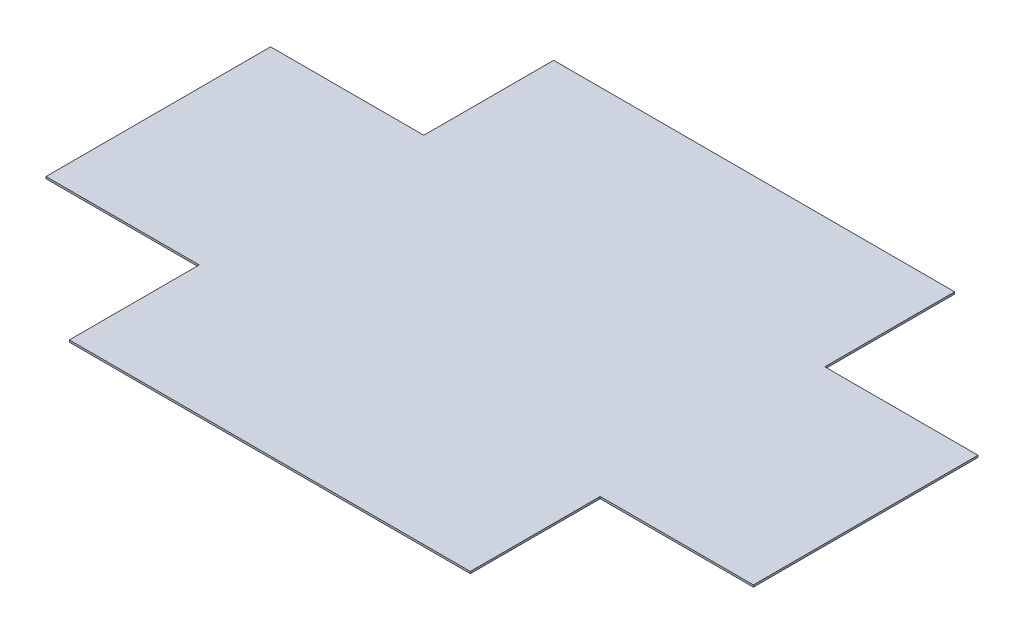
ISO-10303-21;
HEADER;
FILE_DESCRIPTION(('STEP AP214'),'2;1');
FILE_NAME('part.step','',(''),(''),'','','');
FILE_SCHEMA(('AUTOMOTIVE_DESIGN { 1 0 10303 214 1 1 1 1 }'));
ENDSEC;
DATA;
#1=APPLICATION_CONTEXT('core data for automotive mechanical design processes');
#2=APPLICATION_PROTOCOL_DEFINITION('international standard','automotive_design',2000,#1);
#3=PRODUCT_CONTEXT('',#1,'mechanical');
#4=PRODUCT('Part','Part','',(#3));
#5=PRODUCT_RELATED_PRODUCT_CATEGORY('part','',(#4));
#6=PRODUCT_DEFINITION_FORMATION('','',#4);
#7=PRODUCT_DEFINITION_CONTEXT('part definition',#1,'design');
#8=PRODUCT_DEFINITION('design','',#6,#7);
#9=PRODUCT_DEFINITION_SHAPE('','',#8);
#10=(LENGTH_UNIT() NAMED_UNIT(*) SI_UNIT(.MILLI.,.METRE.));
#11=(NAMED_UNIT(*) PLANE_ANGLE_UNIT() SI_UNIT($,.RADIAN.));
#12=(NAMED_UNIT(*) SI_UNIT($,.STERADIAN.) SOLID_ANGLE_UNIT());
#13=UNCERTAINTY_MEASURE_WITH_UNIT(LENGTH_MEASURE(1.E-05),#10,'distance_accuracy_value','');
#14=(GEOMETRIC_REPRESENTATION_CONTEXT(3) GLOBAL_UNCERTAINTY_ASSIGNED_CONTEXT((#13)) GLOBAL_UNIT_ASSIGNED_CONTEXT((#10,
#11,#12)) REPRESENTATION_CONTEXT('',''));
#15=CARTESIAN_POINT('',(0.,0.,0.));
#16=DIRECTION('',(0.,0.,1.));
#17=DIRECTION('',(1.,0.,0.));
#18=AXIS2_PLACEMENT_3D('',#15,#16,#17);
#19=CARTESIAN_POINT('',(0.,-1.49999999999997,0.));
#20=DIRECTION('',(0.,-1.,0.));
#21=DIRECTION('',(0.,0.,-1.));
#22=AXIS2_PLACEMENT_3D('',#19,#20,#21);
#23=PLANE('',#22);
#24=DIRECTION('',(0.,0.,1.));
#25=VECTOR('',#24,1.);
#26=CARTESIAN_POINT('',(-153.464644660941,-1.49999999999995,87.5985458194132));
#27=LINE('',#26,#25);
#28=CARTESIAN_POINT('',(-153.464644660941,-1.49999999999994,85.9646446609406));
#29=VERTEX_POINT('',#28);
#30=CARTESIAN_POINT('',(-153.464644660941,-1.50000000000064,185.361945819413));
#31=VERTEX_POINT('',#30);
#32=EDGE_CURVE('E516',#29,#31,#27,.T.);
#33=ORIENTED_EDGE('',*,*,#32,.F.);
#34=DIRECTION('',(1.,0.,0.));
#35=VECTOR('',#34,1.);
#36=CARTESIAN_POINT('',(-252.223891638827,-1.50000000000064,85.964644660941));
#37=LINE('',#36,#35);
#38=CARTESIAN_POINT('',(-270.723891638827,-1.50000000000089,85.964644660941));
#39=VERTEX_POINT('',#38);
#40=EDGE_CURVE('E13',#39,#29,#37,.T.);
#41=ORIENTED_EDGE('',*,*,#40,.F.);
#42=DIRECTION('',(0.,0.,1.));
#43=VECTOR('',#42,1.);
#44=CARTESIAN_POINT('',(-270.723891638827,-1.50000000000089,85.964644660941));
#45=LINE('',#44,#43);
#46=CARTESIAN_POINT('',(-270.723891638827,-1.50000000000095,-85.9646446609407));
#47=VERTEX_POINT('',#46);
#48=EDGE_CURVE('E563',#47,#39,#45,.T.);
#49=ORIENTED_EDGE('',*,*,#48,.F.);
#50=DIRECTION('',(-1.,0.,0.));
#51=VECTOR('',#50,1.);
#52=CARTESIAN_POINT('',(-270.723891638827,-1.50000000000095,-85.9646446609407));
#53=LINE('',#52,#51);
#54=CARTESIAN_POINT('',(-153.464644660941,-1.5,-85.9646446609407));
#55=VERTEX_POINT('',#54);
#56=EDGE_CURVE('E412',#55,#47,#53,.T.);
#57=ORIENTED_EDGE('',*,*,#56,.F.);
#58=DIRECTION('',(0.,0.,-1.));
#59=VECTOR('',#58,1.);
#60=CARTESIAN_POINT('',(-153.464644660941,-1.5,-87.5985458194133));
#61=LINE('',#60,#59);
#62=CARTESIAN_POINT('',(-153.464644660941,-1.50000000000033,-185.361945819413));
#63=VERTEX_POINT('',#62);
#64=EDGE_CURVE('E575',#55,#63,#61,.T.);
#65=ORIENTED_EDGE('',*,*,#64,.T.);
#66=DIRECTION('',(1.,0.,0.));
#67=VECTOR('',#66,1.);
#68=CARTESIAN_POINT('',(155.,-1.50000000000033,-185.361945819413));
#69=LINE('',#68,#67);
#70=CARTESIAN_POINT('',(153.464644660941,-1.50000000000031,-185.361945819413));
#71=VERTEX_POINT('',#70);
#72=EDGE_CURVE('E439',#71,#63,#69,.F.);
#73=ORIENTED_EDGE('',*,*,#72,.F.);
#74=DIRECTION('',(0.,0.,-1.));
#75=VECTOR('',#74,1.);
#76=CARTESIAN_POINT('',(153.464644660941,-1.49999999999997,-87.5985458194133));
#77=LINE('',#76,#75);
#78=CARTESIAN_POINT('',(153.464644660941,-1.5,-85.9646446609408));
#79=VERTEX_POINT('',#78);
#80=EDGE_CURVE('E564',#79,#71,#77,.T.);
#81=ORIENTED_EDGE('',*,*,#80,.F.);
#82=DIRECTION('',(1.,0.,0.));
#83=VECTOR('',#82,1.);
#84=CARTESIAN_POINT('',(270.723891638827,-1.50000000000089,-85.9646446609407));
#85=LINE('',#84,#83);
#86=CARTESIAN_POINT('',(270.723891638827,-1.50000000000089,-85.9646446609407));
#87=VERTEX_POINT('',#86);
#88=EDGE_CURVE('E554',#87,#79,#85,.F.);
#89=ORIENTED_EDGE('',*,*,#88,.F.);
#90=DIRECTION('',(0.,0.,1.));
#91=VECTOR('',#90,1.);
#92=CARTESIAN_POINT('',(270.723891638827,-1.50000000000089,85.9646446609409));
#93=LINE('',#92,#91);
#94=CARTESIAN_POINT('',(270.723891638827,-1.50000000000089,85.9646446609409));
#95=VERTEX_POINT('',#94);
#96=EDGE_CURVE('E533',#95,#87,#93,.F.);
#97=ORIENTED_EDGE('',*,*,#96,.F.);
#98=DIRECTION('',(-1.,0.,0.));
#99=VECTOR('',#98,1.);
#100=CARTESIAN_POINT('',(252.223891638827,-1.50000000000058,85.9646446609409));
#101=LINE('',#100,#99);
#102=CARTESIAN_POINT('',(153.464644660941,-1.49999999999994,85.9646446609406));
#103=VERTEX_POINT('',#102);
#104=EDGE_CURVE('E461',#103,#95,#101,.F.);
#105=ORIENTED_EDGE('',*,*,#104,.F.);
#106=DIRECTION('',(0.,0.,1.));
#107=VECTOR('',#106,1.);
#108=CARTESIAN_POINT('',(153.464644660941,-1.49999999999995,87.5985458194132));
#109=LINE('',#108,#107);
#110=CARTESIAN_POINT('',(153.464644660941,-1.50000000000064,185.361945819413));
#111=VERTEX_POINT('',#110);
#112=EDGE_CURVE('E542',#103,#111,#109,.T.);
#113=ORIENTED_EDGE('',*,*,#112,.T.);
#114=DIRECTION('',(1.,0.,0.));
#115=VECTOR('',#114,1.);
#116=CARTESIAN_POINT('',(155.,-1.50000000000064,185.361945819413));
#117=LINE('',#116,#115);
#118=EDGE_CURVE('E487',#31,#111,#117,.T.);
#119=ORIENTED_EDGE('',*,*,#118,.F.);
#120=EDGE_LOOP('',(#33,#41,#49,#57,#65,#73,#81,#89,#97,#105,#113,#119));
#121=FACE_BOUND('',#120,.T.);
#122=ADVANCED_FACE('F381',(#121),#23,.T.);
#123=CARTESIAN_POINT('',(0.,0.,0.));
#124=DIRECTION('',(0.,-1.,0.));
#125=DIRECTION('',(0.,0.,-1.));
#126=AXIS2_PLACEMENT_3D('',#123,#124,#125);
#127=PLANE('',#126);
#128=DIRECTION('',(0.,0.,-1.));
#129=VECTOR('',#128,1.);
#130=CARTESIAN_POINT('',(-153.464644660941,0.,-87.5985458194133));
#131=LINE('',#130,#129);
#132=CARTESIAN_POINT('',(-153.464644660941,0.,-85.9646446609407));
#133=VERTEX_POINT('',#132);
#134=CARTESIAN_POINT('',(-153.464644660941,-3.33066907387547E-13,-185.361945819413));
#135=VERTEX_POINT('',#134);
#136=EDGE_CURVE('E489',#133,#135,#131,.T.);
#137=ORIENTED_EDGE('',*,*,#136,.F.);
#138=DIRECTION('',(1.,0.,0.));
#139=VECTOR('',#138,1.);
#140=CARTESIAN_POINT('',(-405.723891638826,-2.80331313717852E-12,-85.9646446609407));
#141=LINE('',#140,#139);
#142=CARTESIAN_POINT('',(-270.723891638827,-9.43689570931383E-13,-85.9646446609407));
#143=VERTEX_POINT('',#142);
#144=EDGE_CURVE('E585',#133,#143,#141,.F.);
#145=ORIENTED_EDGE('',*,*,#144,.T.);
#146=DIRECTION('',(0.,0.,-1.));
#147=VECTOR('',#146,1.);
#148=CARTESIAN_POINT('',(-270.723891638827,-9.43689570931383E-13,0.));
#149=LINE('',#148,#147);
#150=CARTESIAN_POINT('',(-270.723891638827,-8.88178419700125E-13,85.964644660941));
#151=VERTEX_POINT('',#150);
#152=EDGE_CURVE('E518',#143,#151,#149,.F.);
#153=ORIENTED_EDGE('',*,*,#152,.T.);
#154=DIRECTION('',(-1.,0.,0.));
#155=VECTOR('',#154,1.);
#156=CARTESIAN_POINT('',(-405.723891638826,-2.74780198594726E-12,85.964644660941));
#157=LINE('',#156,#155);
#158=CARTESIAN_POINT('',(-153.464644660941,0.,85.9646446609406));
#159=VERTEX_POINT('',#158);
#160=EDGE_CURVE('E391',#151,#159,#157,.F.);
#161=ORIENTED_EDGE('',*,*,#160,.T.);
#162=DIRECTION('',(0.,0.,1.));
#163=VECTOR('',#162,1.);
#164=CARTESIAN_POINT('',(-153.464644660941,0.,87.5985458194132));
#165=LINE('',#164,#163);
#166=CARTESIAN_POINT('',(-153.464644660941,-6.38378239159465E-13,185.361945819413));
#167=VERTEX_POINT('',#166);
#168=EDGE_CURVE('E509',#159,#167,#165,.T.);
#169=ORIENTED_EDGE('',*,*,#168,.T.);
#170=DIRECTION('',(-1.,0.,0.));
#171=VECTOR('',#170,1.);
#172=CARTESIAN_POINT('',(0.,-6.66133814775094E-13,185.361945819413));
#173=LINE('',#172,#171);
#174=CARTESIAN_POINT('',(153.464644660941,-6.38378239159465E-13,185.361945819413));
#175=VERTEX_POINT('',#174);
#176=EDGE_CURVE('E473',#167,#175,#173,.F.);
#177=ORIENTED_EDGE('',*,*,#176,.T.);
#178=DIRECTION('',(0.,0.,1.));
#179=VECTOR('',#178,1.);
#180=CARTESIAN_POINT('',(153.464644660941,0.,87.5985458194132));
#181=LINE('',#180,#179);
#182=CARTESIAN_POINT('',(153.464644660941,0.,85.9646446609406));
#183=VERTEX_POINT('',#182);
#184=EDGE_CURVE('E540',#183,#175,#181,.T.);
#185=ORIENTED_EDGE('',*,*,#184,.F.);
#186=DIRECTION('',(1.,0.,0.));
#187=VECTOR('',#186,1.);
#188=CARTESIAN_POINT('',(405.723891638826,-2.74780198594726E-12,85.9646446609409));
#189=LINE('',#188,#187);
#190=CARTESIAN_POINT('',(270.723891638827,-8.88178419700125E-13,85.9646446609409));
#191=VERTEX_POINT('',#190);
#192=EDGE_CURVE('E555',#183,#191,#189,.T.);
#193=ORIENTED_EDGE('',*,*,#192,.T.);
#194=DIRECTION('',(0.,0.,-1.));
#195=VECTOR('',#194,1.);
#196=CARTESIAN_POINT('',(270.723891638827,-8.88178419700125E-13,0.));
#197=LINE('',#196,#195);
#198=CARTESIAN_POINT('',(270.723891638827,-8.88178419700125E-13,-85.9646446609407));
#199=VERTEX_POINT('',#198);
#200=EDGE_CURVE('E551',#191,#199,#197,.T.);
#201=ORIENTED_EDGE('',*,*,#200,.T.);
#202=DIRECTION('',(-1.,0.,0.));
#203=VECTOR('',#202,1.);
#204=CARTESIAN_POINT('',(405.723891638826,-2.74780198594726E-12,-85.9646446609407));
#205=LINE('',#204,#203);
#206=CARTESIAN_POINT('',(153.464644660941,0.,-85.9646446609408));
#207=VERTEX_POINT('',#206);
#208=EDGE_CURVE('E558',#199,#207,#205,.T.);
#209=ORIENTED_EDGE('',*,*,#208,.T.);
#210=DIRECTION('',(0.,0.,-1.));
#211=VECTOR('',#210,1.);
#212=CARTESIAN_POINT('',(153.464644660941,0.,-87.5985458194133));
#213=LINE('',#212,#211);
#214=CARTESIAN_POINT('',(153.464644660941,-3.05311331771918E-13,-185.361945819413));
#215=VERTEX_POINT('',#214);
#216=EDGE_CURVE('E567',#207,#215,#213,.T.);
#217=ORIENTED_EDGE('',*,*,#216,.T.);
#218=DIRECTION('',(-1.,0.,0.));
#219=VECTOR('',#218,1.);
#220=CARTESIAN_POINT('',(0.,-3.60822483003176E-13,-185.361945819413));
#221=LINE('',#220,#219);
#222=EDGE_CURVE('E425',#215,#135,#221,.T.);
#223=ORIENTED_EDGE('',*,*,#222,.T.);
#224=EDGE_LOOP('',(#137,#145,#153,#161,#169,#177,#185,#193,#201,#209,#217,#223));
#225=FACE_BOUND('',#224,.T.);
#226=ADVANCED_FACE('F383',(#225),#127,.F.);
#227=CARTESIAN_POINT('',(-270.723891638827,-1.50000000000089,85.964644660941));
#228=DIRECTION('',(-1.,0.,0.));
#229=DIRECTION('',(0.,-1.,0.));
#230=AXIS2_PLACEMENT_3D('',#227,#228,#229);
#231=PLANE('',#230);
#232=ORIENTED_EDGE('',*,*,#152,.F.);
#233=DIRECTION('',(0.,1.,0.));
#234=VECTOR('',#233,1.);
#235=CARTESIAN_POINT('',(-270.723891638827,-1.50000000000095,-85.9646446609407));
#236=LINE('',#235,#234);
#237=EDGE_CURVE('E586',#47,#143,#236,.T.);
#238=ORIENTED_EDGE('',*,*,#237,.F.);
#239=ORIENTED_EDGE('',*,*,#48,.T.);
#240=DIRECTION('',(0.,1.,0.));
#241=VECTOR('',#240,1.);
#242=CARTESIAN_POINT('',(-270.723891638827,-1.50000000000089,85.964644660941));
#243=LINE('',#242,#241);
#244=EDGE_CURVE('E399',#39,#151,#243,.T.);
#245=ORIENTED_EDGE('',*,*,#244,.T.);
#246=EDGE_LOOP('',(#232,#238,#239,#245));
#247=FACE_BOUND('',#246,.T.);
#248=ADVANCED_FACE('F631',(#247),#231,.T.);
#249=CARTESIAN_POINT('',(-270.723891638827,-1.50000000000095,-85.9646446609407));
#250=DIRECTION('',(0.,0.,-1.));
#251=DIRECTION('',(0.,-1.,0.));
#252=AXIS2_PLACEMENT_3D('',#249,#250,#251);
#253=PLANE('',#252);
#254=ORIENTED_EDGE('',*,*,#144,.F.);
#255=DIRECTION('',(0.,-1.,0.));
#256=VECTOR('',#255,1.);
#257=CARTESIAN_POINT('',(-153.464644660941,0.,-85.9646446609407));
#258=LINE('',#257,#256);
#259=EDGE_CURVE('E530',#133,#55,#258,.T.);
#260=ORIENTED_EDGE('',*,*,#259,.T.);
#261=ORIENTED_EDGE('',*,*,#56,.T.);
#262=ORIENTED_EDGE('',*,*,#237,.T.);
#263=EDGE_LOOP('',(#254,#260,#261,#262));
#264=FACE_BOUND('',#263,.T.);
#265=ADVANCED_FACE('F636',(#264),#253,.T.);
#266=CARTESIAN_POINT('',(-252.223891638827,-1.50000000000064,85.964644660941));
#267=DIRECTION('',(0.,0.,1.));
#268=DIRECTION('',(0.,1.,0.));
#269=AXIS2_PLACEMENT_3D('',#266,#267,#268);
#270=PLANE('',#269);
#271=ORIENTED_EDGE('',*,*,#40,.T.);
#272=DIRECTION('',(0.,-1.,0.));
#273=VECTOR('',#272,1.);
#274=CARTESIAN_POINT('',(-153.464644660941,0.,85.9646446609406));
#275=LINE('',#274,#273);
#276=EDGE_CURVE('E514',#159,#29,#275,.T.);
#277=ORIENTED_EDGE('',*,*,#276,.F.);
#278=ORIENTED_EDGE('',*,*,#160,.F.);
#279=ORIENTED_EDGE('',*,*,#244,.F.);
#280=EDGE_LOOP('',(#271,#277,#278,#279));
#281=FACE_BOUND('',#280,.T.);
#282=ADVANCED_FACE('F520',(#281),#270,.T.);
#283=CARTESIAN_POINT('',(155.,-1.50000000000033,-185.361945819413));
#284=DIRECTION('',(0.,0.,-1.));
#285=DIRECTION('',(0.,1.,0.));
#286=AXIS2_PLACEMENT_3D('',#283,#284,#285);
#287=PLANE('',#286);
#288=ORIENTED_EDGE('',*,*,#72,.T.);
#289=DIRECTION('',(0.,1.,0.));
#290=VECTOR('',#289,1.);
#291=CARTESIAN_POINT('',(-153.464644660941,-1.50000000000033,-185.361945819413));
#292=LINE('',#291,#290);
#293=EDGE_CURVE('E579',#63,#135,#292,.T.);
#294=ORIENTED_EDGE('',*,*,#293,.T.);
#295=ORIENTED_EDGE('',*,*,#222,.F.);
#296=DIRECTION('',(0.,1.,0.));
#297=VECTOR('',#296,1.);
#298=CARTESIAN_POINT('',(153.464644660941,-1.50000000000031,-185.361945819413));
#299=LINE('',#298,#297);
#300=EDGE_CURVE('E561',#71,#215,#299,.T.);
#301=ORIENTED_EDGE('',*,*,#300,.F.);
#302=EDGE_LOOP('',(#288,#294,#295,#301));
#303=FACE_BOUND('',#302,.T.);
#304=ADVANCED_FACE('F635',(#303),#287,.T.);
#305=CARTESIAN_POINT('',(-153.464644660941,-1.5,-87.5985458194133));
#306=DIRECTION('',(1.,0.,0.));
#307=DIRECTION('',(0.,1.,0.));
#308=AXIS2_PLACEMENT_3D('',#305,#306,#307);
#309=PLANE('',#308);
#310=ORIENTED_EDGE('',*,*,#136,.T.);
#311=ORIENTED_EDGE('',*,*,#293,.F.);
#312=ORIENTED_EDGE('',*,*,#64,.F.);
#313=ORIENTED_EDGE('',*,*,#259,.F.);
#314=EDGE_LOOP('',(#310,#311,#312,#313));
#315=FACE_BOUND('',#314,.T.);
#316=ADVANCED_FACE('F622',(#315),#309,.F.);
#317=CARTESIAN_POINT('',(153.464644660941,-1.49999999999997,-87.5985458194133));
#318=DIRECTION('',(1.,0.,0.));
#319=DIRECTION('',(0.,0.,-1.));
#320=AXIS2_PLACEMENT_3D('',#317,#318,#319);
#321=PLANE('',#320);
#322=ORIENTED_EDGE('',*,*,#216,.F.);
#323=DIRECTION('',(0.,-1.,0.));
#324=VECTOR('',#323,1.);
#325=CARTESIAN_POINT('',(153.464644660941,0.,-85.9646446609408));
#326=LINE('',#325,#324);
#327=EDGE_CURVE('E525',#207,#79,#326,.T.);
#328=ORIENTED_EDGE('',*,*,#327,.T.);
#329=ORIENTED_EDGE('',*,*,#80,.T.);
#330=ORIENTED_EDGE('',*,*,#300,.T.);
#331=EDGE_LOOP('',(#322,#328,#329,#330));
#332=FACE_BOUND('',#331,.T.);
#333=ADVANCED_FACE('F614',(#332),#321,.T.);
#334=CARTESIAN_POINT('',(270.723891638827,-1.50000000000089,85.9646446609409));
#335=DIRECTION('',(1.,0.,0.));
#336=DIRECTION('',(0.,1.,0.));
#337=AXIS2_PLACEMENT_3D('',#334,#335,#336);
#338=PLANE('',#337);
#339=ORIENTED_EDGE('',*,*,#200,.F.);
#340=DIRECTION('',(0.,1.,0.));
#341=VECTOR('',#340,1.);
#342=CARTESIAN_POINT('',(270.723891638827,-1.50000000000089,85.9646446609409));
#343=LINE('',#342,#341);
#344=EDGE_CURVE('E556',#95,#191,#343,.T.);
#345=ORIENTED_EDGE('',*,*,#344,.F.);
#346=ORIENTED_EDGE('',*,*,#96,.T.);
#347=DIRECTION('',(0.,1.,0.));
#348=VECTOR('',#347,1.);
#349=CARTESIAN_POINT('',(270.723891638827,-1.50000000000089,-85.9646446609407));
#350=LINE('',#349,#348);
#351=EDGE_CURVE('E448',#87,#199,#350,.T.);
#352=ORIENTED_EDGE('',*,*,#351,.T.);
#353=EDGE_LOOP('',(#339,#345,#346,#352));
#354=FACE_BOUND('',#353,.T.);
#355=ADVANCED_FACE('F612',(#354),#338,.T.);
#356=CARTESIAN_POINT('',(252.223891638827,-1.50000000000058,85.9646446609409));
#357=DIRECTION('',(0.,0.,1.));
#358=DIRECTION('',(0.,1.,0.));
#359=AXIS2_PLACEMENT_3D('',#356,#357,#358);
#360=PLANE('',#359);
#361=ORIENTED_EDGE('',*,*,#192,.F.);
#362=DIRECTION('',(0.,-1.,0.));
#363=VECTOR('',#362,1.);
#364=CARTESIAN_POINT('',(153.464644660941,0.,85.9646446609406));
#365=LINE('',#364,#363);
#366=EDGE_CURVE('E523',#183,#103,#365,.T.);
#367=ORIENTED_EDGE('',*,*,#366,.T.);
#368=ORIENTED_EDGE('',*,*,#104,.T.);
#369=ORIENTED_EDGE('',*,*,#344,.T.);
#370=EDGE_LOOP('',(#361,#367,#368,#369));
#371=FACE_BOUND('',#370,.T.);
#372=ADVANCED_FACE('F610',(#371),#360,.T.);
#373=CARTESIAN_POINT('',(270.723891638827,-1.50000000000089,-85.9646446609407));
#374=DIRECTION('',(0.,0.,-1.));
#375=DIRECTION('',(0.,-1.,0.));
#376=AXIS2_PLACEMENT_3D('',#373,#374,#375);
#377=PLANE('',#376);
#378=ORIENTED_EDGE('',*,*,#88,.T.);
#379=ORIENTED_EDGE('',*,*,#327,.F.);
#380=ORIENTED_EDGE('',*,*,#208,.F.);
#381=ORIENTED_EDGE('',*,*,#351,.F.);
#382=EDGE_LOOP('',(#378,#379,#380,#381));
#383=FACE_BOUND('',#382,.T.);
#384=ADVANCED_FACE('F620',(#383),#377,.T.);
#385=CARTESIAN_POINT('',(155.,-1.50000000000064,185.361945819413));
#386=DIRECTION('',(0.,0.,1.));
#387=DIRECTION('',(0.,-1.,0.));
#388=AXIS2_PLACEMENT_3D('',#385,#386,#387);
#389=PLANE('',#388);
#390=ORIENTED_EDGE('',*,*,#118,.T.);
#391=DIRECTION('',(0.,1.,0.));
#392=VECTOR('',#391,1.);
#393=CARTESIAN_POINT('',(153.464644660941,-1.50000000000064,185.361945819413));
#394=LINE('',#393,#392);
#395=EDGE_CURVE('E546',#111,#175,#394,.T.);
#396=ORIENTED_EDGE('',*,*,#395,.T.);
#397=ORIENTED_EDGE('',*,*,#176,.F.);
#398=DIRECTION('',(0.,1.,0.));
#399=VECTOR('',#398,1.);
#400=CARTESIAN_POINT('',(-153.464644660941,-1.50000000000064,185.361945819413));
#401=LINE('',#400,#399);
#402=EDGE_CURVE('E515',#31,#167,#401,.T.);
#403=ORIENTED_EDGE('',*,*,#402,.F.);
#404=EDGE_LOOP('',(#390,#396,#397,#403));
#405=FACE_BOUND('',#404,.T.);
#406=ADVANCED_FACE('F647',(#405),#389,.T.);
#407=CARTESIAN_POINT('',(153.464644660941,-1.49999999999995,87.5985458194132));
#408=DIRECTION('',(-1.,0.,0.));
#409=DIRECTION('',(0.,-1.,0.));
#410=AXIS2_PLACEMENT_3D('',#407,#408,#409);
#411=PLANE('',#410);
#412=ORIENTED_EDGE('',*,*,#184,.T.);
#413=ORIENTED_EDGE('',*,*,#395,.F.);
#414=ORIENTED_EDGE('',*,*,#112,.F.);
#415=ORIENTED_EDGE('',*,*,#366,.F.);
#416=EDGE_LOOP('',(#412,#413,#414,#415));
#417=FACE_BOUND('',#416,.T.);
#418=ADVANCED_FACE('F651',(#417),#411,.F.);
#419=CARTESIAN_POINT('',(-153.464644660941,-1.49999999999995,87.5985458194132));
#420=DIRECTION('',(-1.,0.,0.));
#421=DIRECTION('',(0.,0.,-1.));
#422=AXIS2_PLACEMENT_3D('',#419,#420,#421);
#423=PLANE('',#422);
#424=ORIENTED_EDGE('',*,*,#168,.F.);
#425=ORIENTED_EDGE('',*,*,#276,.T.);
#426=ORIENTED_EDGE('',*,*,#32,.T.);
#427=ORIENTED_EDGE('',*,*,#402,.T.);
#428=EDGE_LOOP('',(#424,#425,#426,#427));
#429=FACE_BOUND('',#428,.T.);
#430=ADVANCED_FACE('F511',(#429),#423,.T.);
#431=CLOSED_SHELL('',(#122,#226,#248,#265,#282,#304,#316,#333,#355,#372,#384,#406,#418,#430));
#432=MANIFOLD_SOLID_BREP('B2',#431);
#433=ADVANCED_BREP_SHAPE_REPRESENTATION('',(#18,#432),#14);
#434=SHAPE_DEFINITION_REPRESENTATION(#9,#433);
ENDSEC;
END-ISO-10303-21;
